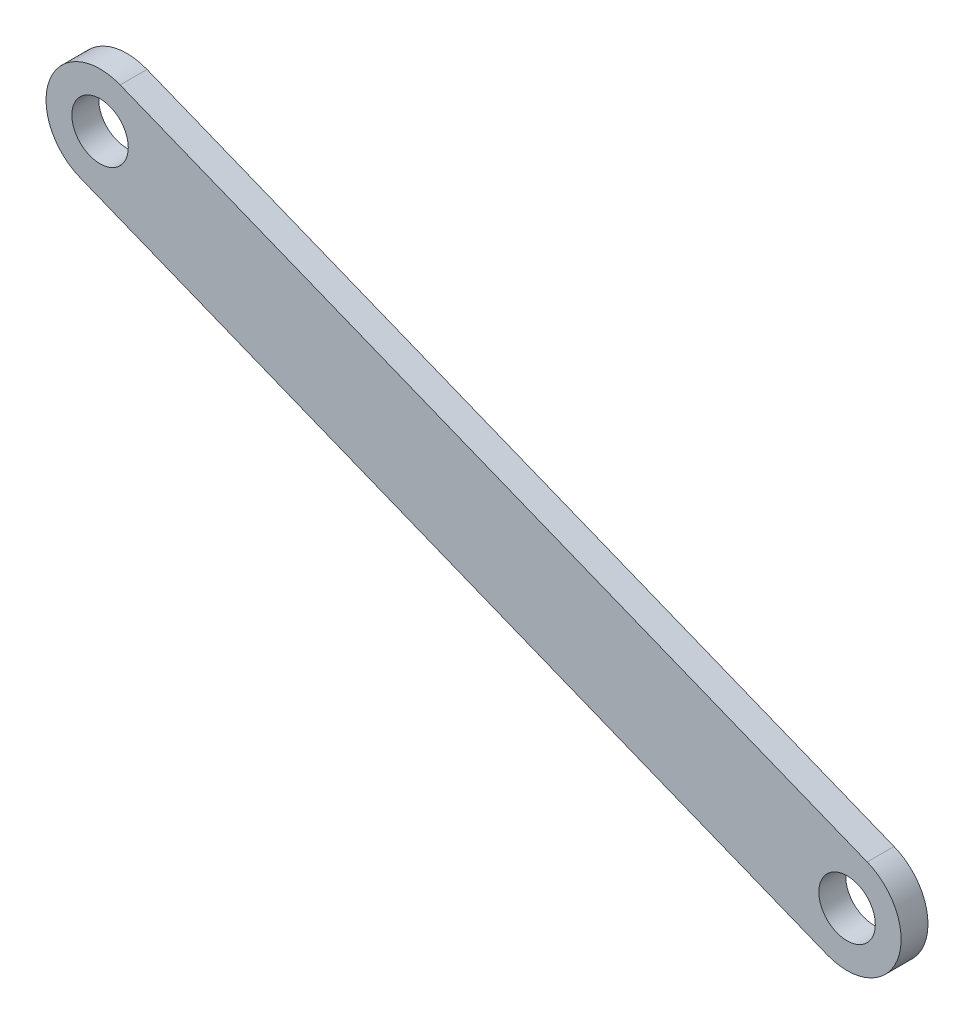
ISO-10303-21;
HEADER;
FILE_DESCRIPTION(('STEP AP214'),'2;1');
FILE_NAME('part.step','',(''),(''),'','','');
FILE_SCHEMA(('AUTOMOTIVE_DESIGN { 1 0 10303 214 1 1 1 1 }'));
ENDSEC;
DATA;
#1=APPLICATION_CONTEXT('core data for automotive mechanical design processes');
#2=APPLICATION_PROTOCOL_DEFINITION('international standard','automotive_design',2000,#1);
#3=PRODUCT_CONTEXT('',#1,'mechanical');
#4=PRODUCT('Part','Part','',(#3));
#5=PRODUCT_RELATED_PRODUCT_CATEGORY('part','',(#4));
#6=PRODUCT_DEFINITION_FORMATION('','',#4);
#7=PRODUCT_DEFINITION_CONTEXT('part definition',#1,'design');
#8=PRODUCT_DEFINITION('design','',#6,#7);
#9=PRODUCT_DEFINITION_SHAPE('','',#8);
#10=(LENGTH_UNIT() NAMED_UNIT(*) SI_UNIT(.MILLI.,.METRE.));
#11=(NAMED_UNIT(*) PLANE_ANGLE_UNIT() SI_UNIT($,.RADIAN.));
#12=(NAMED_UNIT(*) SI_UNIT($,.STERADIAN.) SOLID_ANGLE_UNIT());
#13=UNCERTAINTY_MEASURE_WITH_UNIT(LENGTH_MEASURE(1.E-05),#10,'distance_accuracy_value','');
#14=(GEOMETRIC_REPRESENTATION_CONTEXT(3) GLOBAL_UNCERTAINTY_ASSIGNED_CONTEXT((#13)) GLOBAL_UNIT_ASSIGNED_CONTEXT((#10,
#11,#12)) REPRESENTATION_CONTEXT('',''));
#15=CARTESIAN_POINT('',(0.,0.,0.));
#16=DIRECTION('',(0.,0.,1.));
#17=DIRECTION('',(1.,0.,0.));
#18=AXIS2_PLACEMENT_3D('',#15,#16,#17);
#19=CARTESIAN_POINT('',(-245.036315390696,-22.4424659145519,4.));
#20=DIRECTION('',(0.,0.,-1.));
#21=DIRECTION('',(-1.,0.,0.));
#22=AXIS2_PLACEMENT_3D('',#19,#20,#21);
#23=CYLINDRICAL_SURFACE('',#22,8.04120954042349);
#24=CARTESIAN_POINT('',(-245.036315390696,-22.4424659145519,0.));
#25=DIRECTION('',(0.,0.,1.));
#26=DIRECTION('',(1.,0.,0.));
#27=AXIS2_PLACEMENT_3D('',#24,#25,#26);
#28=CIRCLE('',#27,8.04120954042349);
#29=CARTESIAN_POINT('',(-242.044749956265,-14.9784464126672,0.));
#30=VERTEX_POINT('',#29);
#31=CARTESIAN_POINT('',(-248.027880825127,-29.9064854164366,0.));
#32=VERTEX_POINT('',#31);
#33=EDGE_CURVE('E96',#30,#32,#28,.T.);
#34=ORIENTED_EDGE('',*,*,#33,.T.);
#35=DIRECTION('',(0.,0.,-1.));
#36=VECTOR('',#35,1.);
#37=CARTESIAN_POINT('',(-248.027880825127,-29.9064854164366,4.));
#38=LINE('',#37,#36);
#39=CARTESIAN_POINT('',(-248.027880825127,-29.9064854164366,4.));
#40=VERTEX_POINT('',#39);
#41=EDGE_CURVE('E11',#40,#32,#38,.T.);
#42=ORIENTED_EDGE('',*,*,#41,.F.);
#43=CARTESIAN_POINT('',(-245.036315390696,-22.4424659145519,4.));
#44=DIRECTION('',(0.,0.,1.));
#45=DIRECTION('',(1.,0.,0.));
#46=AXIS2_PLACEMENT_3D('',#43,#44,#45);
#47=CIRCLE('',#46,8.04120954042349);
#48=CARTESIAN_POINT('',(-242.044749956265,-14.9784464126672,4.));
#49=VERTEX_POINT('',#48);
#50=EDGE_CURVE('E84',#49,#40,#47,.T.);
#51=ORIENTED_EDGE('',*,*,#50,.F.);
#52=DIRECTION('',(0.,0.,-1.));
#53=VECTOR('',#52,1.);
#54=CARTESIAN_POINT('',(-242.044749956265,-14.9784464126672,4.));
#55=LINE('',#54,#53);
#56=EDGE_CURVE('E92',#49,#30,#55,.T.);
#57=ORIENTED_EDGE('',*,*,#56,.T.);
#58=EDGE_LOOP('',(#34,#42,#51,#57));
#59=FACE_BOUND('',#58,.T.);
#60=ADVANCED_FACE('F33',(#59),#23,.T.);
#61=CARTESIAN_POINT('',(-248.027880825127,-29.9064854164366,4.));
#62=DIRECTION('',(0.372029284822433,0.928220992670662,0.));
#63=DIRECTION('',(-0.928220992670662,0.372029284822433,0.));
#64=AXIS2_PLACEMENT_3D('',#61,#62,#63);
#65=PLANE('',#64);
#66=DIRECTION('',(0.928220992670662,-0.372029284822433,0.));
#67=VECTOR('',#66,1.);
#68=CARTESIAN_POINT('',(-248.027880825127,-29.9064854164366,0.));
#69=LINE('',#68,#67);
#70=CARTESIAN_POINT('',(-136.822223225748,-74.4775106265767,0.));
#71=VERTEX_POINT('',#70);
#72=EDGE_CURVE('E88',#32,#71,#69,.T.);
#73=ORIENTED_EDGE('',*,*,#72,.T.);
#74=DIRECTION('',(0.,0.,-1.));
#75=VECTOR('',#74,1.);
#76=CARTESIAN_POINT('',(-136.822223225748,-74.4775106265767,4.));
#77=LINE('',#76,#75);
#78=CARTESIAN_POINT('',(-136.822223225748,-74.4775106265767,4.));
#79=VERTEX_POINT('',#78);
#80=EDGE_CURVE('E41',#79,#71,#77,.T.);
#81=ORIENTED_EDGE('',*,*,#80,.F.);
#82=DIRECTION('',(0.928220992670662,-0.372029284822433,0.));
#83=VECTOR('',#82,1.);
#84=CARTESIAN_POINT('',(-248.027880825127,-29.9064854164366,4.));
#85=LINE('',#84,#83);
#86=EDGE_CURVE('E79',#40,#79,#85,.T.);
#87=ORIENTED_EDGE('',*,*,#86,.F.);
#88=ORIENTED_EDGE('',*,*,#41,.T.);
#89=EDGE_LOOP('',(#73,#81,#87,#88));
#90=FACE_BOUND('',#89,.T.);
#91=ADVANCED_FACE('F87',(#90),#65,.F.);
#92=CARTESIAN_POINT('',(-133.830657791317,-67.013491124692,4.));
#93=DIRECTION('',(0.,0.,-1.));
#94=DIRECTION('',(-1.,0.,0.));
#95=AXIS2_PLACEMENT_3D('',#92,#93,#94);
#96=CYLINDRICAL_SURFACE('',#95,8.04120954042349);
#97=CARTESIAN_POINT('',(-133.830657791317,-67.013491124692,0.));
#98=DIRECTION('',(0.,0.,1.));
#99=DIRECTION('',(1.,0.,0.));
#100=AXIS2_PLACEMENT_3D('',#97,#98,#99);
#101=CIRCLE('',#100,8.04120954042349);
#102=CARTESIAN_POINT('',(-130.839092356886,-59.5494716228073,0.));
#103=VERTEX_POINT('',#102);
#104=EDGE_CURVE('E66',#71,#103,#101,.T.);
#105=ORIENTED_EDGE('',*,*,#104,.T.);
#106=DIRECTION('',(0.,0.,-1.));
#107=VECTOR('',#106,1.);
#108=CARTESIAN_POINT('',(-130.839092356886,-59.5494716228073,4.));
#109=LINE('',#108,#107);
#110=CARTESIAN_POINT('',(-130.839092356886,-59.5494716228073,4.));
#111=VERTEX_POINT('',#110);
#112=EDGE_CURVE('E89',#111,#103,#109,.T.);
#113=ORIENTED_EDGE('',*,*,#112,.F.);
#114=CARTESIAN_POINT('',(-133.830657791317,-67.013491124692,4.));
#115=DIRECTION('',(0.,0.,1.));
#116=DIRECTION('',(1.,0.,0.));
#117=AXIS2_PLACEMENT_3D('',#114,#115,#116);
#118=CIRCLE('',#117,8.04120954042349);
#119=EDGE_CURVE('E82',#79,#111,#118,.T.);
#120=ORIENTED_EDGE('',*,*,#119,.F.);
#121=ORIENTED_EDGE('',*,*,#80,.T.);
#122=EDGE_LOOP('',(#105,#113,#120,#121));
#123=FACE_BOUND('',#122,.T.);
#124=ADVANCED_FACE('F90',(#123),#96,.T.);
#125=CARTESIAN_POINT('',(-242.044749956265,-14.9784464126672,4.));
#126=DIRECTION('',(-0.372029284822433,-0.928220992670662,0.));
#127=DIRECTION('',(0.928220992670662,-0.372029284822433,0.));
#128=AXIS2_PLACEMENT_3D('',#125,#126,#127);
#129=PLANE('',#128);
#130=DIRECTION('',(-0.928220992670662,0.372029284822433,0.));
#131=VECTOR('',#130,1.);
#132=CARTESIAN_POINT('',(-242.044749956265,-14.9784464126672,0.));
#133=LINE('',#132,#131);
#134=EDGE_CURVE('E72',#103,#30,#133,.T.);
#135=ORIENTED_EDGE('',*,*,#134,.T.);
#136=ORIENTED_EDGE('',*,*,#56,.F.);
#137=DIRECTION('',(-0.928220992670662,0.372029284822433,0.));
#138=VECTOR('',#137,1.);
#139=CARTESIAN_POINT('',(-242.044749956265,-14.9784464126672,4.));
#140=LINE('',#139,#138);
#141=EDGE_CURVE('E49',#111,#49,#140,.T.);
#142=ORIENTED_EDGE('',*,*,#141,.F.);
#143=ORIENTED_EDGE('',*,*,#112,.T.);
#144=EDGE_LOOP('',(#135,#136,#142,#143));
#145=FACE_BOUND('',#144,.T.);
#146=ADVANCED_FACE('F104',(#145),#129,.F.);
#147=CARTESIAN_POINT('',(-245.036315390696,-22.4424659145519,4.));
#148=DIRECTION('',(0.,0.,1.));
#149=DIRECTION('',(1.,0.,0.));
#150=AXIS2_PLACEMENT_3D('',#147,#148,#149);
#151=PLANE('',#150);
#152=CARTESIAN_POINT('',(-245.036315390696,-22.4424659145519,4.));
#153=DIRECTION('',(0.,0.,1.));
#154=DIRECTION('',(1.,0.,0.));
#155=AXIS2_PLACEMENT_3D('',#152,#153,#154);
#156=CIRCLE('',#155,4.20000000000001);
#157=CARTESIAN_POINT('',(-240.836315390696,-22.4424659145519,4.));
#158=VERTEX_POINT('',#157);
#159=EDGE_CURVE('E118',#158,#158,#156,.T.);
#160=ORIENTED_EDGE('',*,*,#159,.F.);
#161=EDGE_LOOP('',(#160));
#162=FACE_BOUND('',#161,.T.);
#163=CARTESIAN_POINT('',(-133.830657791317,-67.013491124692,4.));
#164=DIRECTION('',(0.,0.,1.));
#165=DIRECTION('',(1.,0.,0.));
#166=AXIS2_PLACEMENT_3D('',#163,#164,#165);
#167=CIRCLE('',#166,4.20000000000001);
#168=CARTESIAN_POINT('',(-129.630657791317,-67.013491124692,4.));
#169=VERTEX_POINT('',#168);
#170=EDGE_CURVE('E112',#169,#169,#167,.T.);
#171=ORIENTED_EDGE('',*,*,#170,.F.);
#172=EDGE_LOOP('',(#171));
#173=FACE_BOUND('',#172,.T.);
#174=ORIENTED_EDGE('',*,*,#50,.T.);
#175=ORIENTED_EDGE('',*,*,#86,.T.);
#176=ORIENTED_EDGE('',*,*,#119,.T.);
#177=ORIENTED_EDGE('',*,*,#141,.T.);
#178=EDGE_LOOP('',(#174,#175,#176,#177));
#179=FACE_BOUND('',#178,.T.);
#180=ADVANCED_FACE('F80',(#162,#173,#179),#151,.T.);
#181=CARTESIAN_POINT('',(-245.036315390696,-22.4424659145519,0.));
#182=DIRECTION('',(0.,0.,1.));
#183=DIRECTION('',(1.,0.,0.));
#184=AXIS2_PLACEMENT_3D('',#181,#182,#183);
#185=PLANE('',#184);
#186=CARTESIAN_POINT('',(-245.036315390696,-22.4424659145519,0.));
#187=DIRECTION('',(0.,0.,1.));
#188=DIRECTION('',(1.,0.,0.));
#189=AXIS2_PLACEMENT_3D('',#186,#187,#188);
#190=CIRCLE('',#189,4.20000000000001);
#191=CARTESIAN_POINT('',(-240.836315390696,-22.4424659145519,0.));
#192=VERTEX_POINT('',#191);
#193=EDGE_CURVE('E115',#192,#192,#190,.T.);
#194=ORIENTED_EDGE('',*,*,#193,.T.);
#195=EDGE_LOOP('',(#194));
#196=FACE_BOUND('',#195,.T.);
#197=CARTESIAN_POINT('',(-133.830657791317,-67.013491124692,0.));
#198=DIRECTION('',(0.,0.,1.));
#199=DIRECTION('',(1.,0.,0.));
#200=AXIS2_PLACEMENT_3D('',#197,#198,#199);
#201=CIRCLE('',#200,4.20000000000001);
#202=CARTESIAN_POINT('',(-129.630657791317,-67.013491124692,0.));
#203=VERTEX_POINT('',#202);
#204=EDGE_CURVE('E99',#203,#203,#201,.T.);
#205=ORIENTED_EDGE('',*,*,#204,.T.);
#206=EDGE_LOOP('',(#205));
#207=FACE_BOUND('',#206,.T.);
#208=ORIENTED_EDGE('',*,*,#33,.F.);
#209=ORIENTED_EDGE('',*,*,#134,.F.);
#210=ORIENTED_EDGE('',*,*,#104,.F.);
#211=ORIENTED_EDGE('',*,*,#72,.F.);
#212=EDGE_LOOP('',(#208,#209,#210,#211));
#213=FACE_BOUND('',#212,.T.);
#214=ADVANCED_FACE('F107',(#196,#207,#213),#185,.F.);
#215=CARTESIAN_POINT('',(-133.830657791317,-67.013491124692,4.));
#216=DIRECTION('',(0.,0.,1.));
#217=DIRECTION('',(1.,0.,0.));
#218=AXIS2_PLACEMENT_3D('',#215,#216,#217);
#219=CYLINDRICAL_SURFACE('',#218,4.20000000000001);
#220=ORIENTED_EDGE('',*,*,#204,.F.);
#221=EDGE_LOOP('',(#220));
#222=FACE_BOUND('',#221,.T.);
#223=ORIENTED_EDGE('',*,*,#170,.T.);
#224=EDGE_LOOP('',(#223));
#225=FACE_BOUND('',#224,.T.);
#226=ADVANCED_FACE('F129',(#222,#225),#219,.F.);
#227=CARTESIAN_POINT('',(-245.036315390696,-22.4424659145519,4.));
#228=DIRECTION('',(0.,0.,1.));
#229=DIRECTION('',(1.,0.,0.));
#230=AXIS2_PLACEMENT_3D('',#227,#228,#229);
#231=CYLINDRICAL_SURFACE('',#230,4.20000000000001);
#232=ORIENTED_EDGE('',*,*,#193,.F.);
#233=EDGE_LOOP('',(#232));
#234=FACE_BOUND('',#233,.T.);
#235=ORIENTED_EDGE('',*,*,#159,.T.);
#236=EDGE_LOOP('',(#235));
#237=FACE_BOUND('',#236,.T.);
#238=ADVANCED_FACE('F122',(#234,#237),#231,.F.);
#239=CLOSED_SHELL('',(#60,#91,#124,#146,#180,#214,#226,#238));
#240=MANIFOLD_SOLID_BREP('B2',#239);
#241=ADVANCED_BREP_SHAPE_REPRESENTATION('',(#18,#240),#14);
#242=SHAPE_DEFINITION_REPRESENTATION(#9,#241);
ENDSEC;
END-ISO-10303-21;
